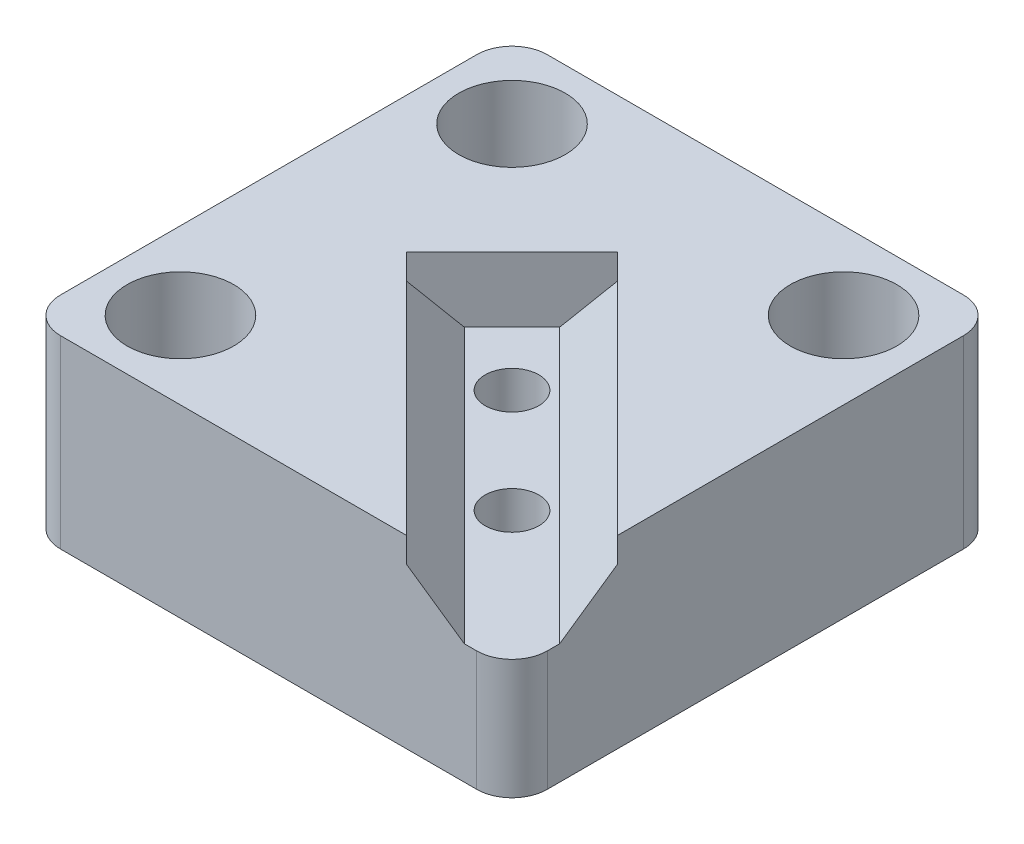
ISO-10303-21;
HEADER;
FILE_DESCRIPTION(('STEP AP214'),'2;1');
FILE_NAME('part.step','',(''),(''),'','','');
FILE_SCHEMA(('AUTOMOTIVE_DESIGN { 1 0 10303 214 1 1 1 1 }'));
ENDSEC;
DATA;
#1=APPLICATION_CONTEXT('core data for automotive mechanical design processes');
#2=APPLICATION_PROTOCOL_DEFINITION('international standard','automotive_design',2000,#1);
#3=PRODUCT_CONTEXT('',#1,'mechanical');
#4=PRODUCT('Part','Part','',(#3));
#5=PRODUCT_RELATED_PRODUCT_CATEGORY('part','',(#4));
#6=PRODUCT_DEFINITION_FORMATION('','',#4);
#7=PRODUCT_DEFINITION_CONTEXT('part definition',#1,'design');
#8=PRODUCT_DEFINITION('design','',#6,#7);
#9=PRODUCT_DEFINITION_SHAPE('','',#8);
#10=(LENGTH_UNIT() NAMED_UNIT(*) SI_UNIT(.MILLI.,.METRE.));
#11=(NAMED_UNIT(*) PLANE_ANGLE_UNIT() SI_UNIT($,.RADIAN.));
#12=(NAMED_UNIT(*) SI_UNIT($,.STERADIAN.) SOLID_ANGLE_UNIT());
#13=UNCERTAINTY_MEASURE_WITH_UNIT(LENGTH_MEASURE(1.E-05),#10,'distance_accuracy_value','');
#14=(GEOMETRIC_REPRESENTATION_CONTEXT(3) GLOBAL_UNCERTAINTY_ASSIGNED_CONTEXT((#13)) GLOBAL_UNIT_ASSIGNED_CONTEXT((#10,
#11,#12)) REPRESENTATION_CONTEXT('',''));
#15=CARTESIAN_POINT('',(0.,0.,0.));
#16=DIRECTION('',(0.,0.,1.));
#17=DIRECTION('',(1.,0.,0.));
#18=AXIS2_PLACEMENT_3D('',#15,#16,#17);
#19=CARTESIAN_POINT('',(28.8663335067468,12.954,23.7116664932532));
#20=DIRECTION('',(0.,-1.,0.));
#21=DIRECTION('',(0.,0.,-1.));
#22=AXIS2_PLACEMENT_3D('',#19,#20,#21);
#23=PLANE('',#22);
#24=CARTESIAN_POINT('',(0.,12.954,0.));
#25=DIRECTION('',(0.,-1.,0.));
#26=DIRECTION('',(0.,0.,-1.));
#27=AXIS2_PLACEMENT_3D('',#24,#25,#26);
#28=CIRCLE('',#27,2.8956);
#29=CARTESIAN_POINT('',(0.,12.954,-2.8956));
#30=VERTEX_POINT('',#29);
#31=EDGE_CURVE('E159',#30,#30,#28,.T.);
#32=ORIENTED_EDGE('',*,*,#31,.T.);
#33=EDGE_LOOP('',(#32));
#34=FACE_BOUND('',#33,.T.);
#35=DIRECTION('',(-1.,0.,0.));
#36=VECTOR('',#35,1.);
#37=CARTESIAN_POINT('',(26.289,12.954,26.289));
#38=LINE('',#37,#36);
#39=CARTESIAN_POINT('',(22.479,12.954,26.289));
#40=VERTEX_POINT('',#39);
#41=CARTESIAN_POINT('',(21.1343329865063,12.954,26.289));
#42=VERTEX_POINT('',#41);
#43=EDGE_CURVE('E179',#40,#42,#38,.T.);
#44=ORIENTED_EDGE('',*,*,#43,.F.);
#45=CARTESIAN_POINT('',(22.479,12.954,22.479));
#46=DIRECTION('',(0.,-1.,0.));
#47=DIRECTION('',(0.,0.,-1.));
#48=AXIS2_PLACEMENT_3D('',#45,#46,#47);
#49=CIRCLE('',#48,3.81);
#50=CARTESIAN_POINT('',(26.289,12.954,22.479));
#51=VERTEX_POINT('',#50);
#52=EDGE_CURVE('E11',#40,#51,#49,.F.);
#53=ORIENTED_EDGE('',*,*,#52,.T.);
#54=DIRECTION('',(0.,0.,1.));
#55=VECTOR('',#54,1.);
#56=CARTESIAN_POINT('',(26.289,12.954,26.289));
#57=LINE('',#56,#55);
#58=CARTESIAN_POINT('',(26.289,12.954,21.1343329865063));
#59=VERTEX_POINT('',#58);
#60=EDGE_CURVE('E244',#59,#51,#57,.T.);
#61=ORIENTED_EDGE('',*,*,#60,.F.);
#62=DIRECTION('',(-0.707106781186547,0.,-0.707106781186547));
#63=VECTOR('',#62,1.);
#64=CARTESIAN_POINT('',(28.8663335067468,12.954,23.7116664932532));
#65=LINE('',#64,#63);
#66=CARTESIAN_POINT('',(-3.3226947647956,12.954,-8.47736177828927));
#67=VERTEX_POINT('',#66);
#68=EDGE_CURVE('E141',#59,#67,#65,.T.);
#69=ORIENTED_EDGE('',*,*,#68,.T.);
#70=DIRECTION('',(-0.707106781186547,0.,0.707106781186548));
#71=VECTOR('',#70,1.);
#72=CARTESIAN_POINT('',(-3.3226947647956,12.954,-8.47736177828927));
#73=LINE('',#72,#71);
#74=CARTESIAN_POINT('',(-8.4773617782893,12.954,-3.32269476479557));
#75=VERTEX_POINT('',#74);
#76=EDGE_CURVE('E151',#67,#75,#73,.T.);
#77=ORIENTED_EDGE('',*,*,#76,.T.);
#78=DIRECTION('',(-0.707106781186547,0.,-0.707106781186547));
#79=VECTOR('',#78,1.);
#80=CARTESIAN_POINT('',(23.7116664932531,12.954,28.8663335067469));
#81=LINE('',#80,#79);
#82=EDGE_CURVE('E172',#42,#75,#81,.T.);
#83=ORIENTED_EDGE('',*,*,#82,.F.);
#84=EDGE_LOOP('',(#44,#53,#61,#69,#77,#83));
#85=FACE_BOUND('',#84,.T.);
#86=CARTESIAN_POINT('',(11.24204,12.954,11.24204));
#87=DIRECTION('',(0.,-1.,0.));
#88=DIRECTION('',(0.,0.,-1.));
#89=AXIS2_PLACEMENT_3D('',#86,#87,#88);
#90=CIRCLE('',#89,2.8956);
#91=CARTESIAN_POINT('',(11.24204,12.954,8.34644));
#92=VERTEX_POINT('',#91);
#93=EDGE_CURVE('E628',#92,#92,#90,.T.);
#94=ORIENTED_EDGE('',*,*,#93,.T.);
#95=EDGE_LOOP('',(#94));
#96=FACE_BOUND('',#95,.T.);
#97=ADVANCED_FACE('F31',(#34,#85,#96),#23,.F.);
#98=CARTESIAN_POINT('',(-26.289,0.,-26.289));
#99=DIRECTION('',(0.,1.,0.));
#100=DIRECTION('',(0.,0.,1.));
#101=AXIS2_PLACEMENT_3D('',#98,#99,#100);
#102=PLANE('',#101);
#103=CARTESIAN_POINT('',(11.24204,0.,11.24204));
#104=DIRECTION('',(0.,-1.,0.));
#105=DIRECTION('',(0.,0.,-1.));
#106=AXIS2_PLACEMENT_3D('',#103,#104,#105);
#107=CIRCLE('',#106,5.9055);
#108=CARTESIAN_POINT('',(11.24204,0.,5.33654));
#109=VERTEX_POINT('',#108);
#110=EDGE_CURVE('E613',#109,#109,#107,.T.);
#111=ORIENTED_EDGE('',*,*,#110,.F.);
#112=EDGE_LOOP('',(#111));
#113=FACE_BOUND('',#112,.T.);
#114=CARTESIAN_POINT('',(0.,0.,0.));
#115=DIRECTION('',(0.,-1.,0.));
#116=DIRECTION('',(0.,0.,-1.));
#117=AXIS2_PLACEMENT_3D('',#114,#115,#116);
#118=CIRCLE('',#117,5.9055);
#119=CARTESIAN_POINT('',(0.,0.,-5.9055));
#120=VERTEX_POINT('',#119);
#121=EDGE_CURVE('E615',#120,#120,#118,.T.);
#122=ORIENTED_EDGE('',*,*,#121,.F.);
#123=EDGE_LOOP('',(#122));
#124=FACE_BOUND('',#123,.T.);
#125=CARTESIAN_POINT('',(-17.907,0.,17.907));
#126=DIRECTION('',(0.,1.,0.));
#127=DIRECTION('',(0.,0.,1.));
#128=AXIS2_PLACEMENT_3D('',#125,#126,#127);
#129=CIRCLE('',#128,2.667);
#130=CARTESIAN_POINT('',(-17.907,0.,20.574));
#131=VERTEX_POINT('',#130);
#132=EDGE_CURVE('E211',#131,#131,#129,.T.);
#133=ORIENTED_EDGE('',*,*,#132,.T.);
#134=EDGE_LOOP('',(#133));
#135=FACE_BOUND('',#134,.T.);
#136=DIRECTION('',(0.,0.,1.));
#137=VECTOR('',#136,1.);
#138=CARTESIAN_POINT('',(-26.289,0.,26.289));
#139=LINE('',#138,#137);
#140=CARTESIAN_POINT('',(-26.289,0.,-22.479));
#141=VERTEX_POINT('',#140);
#142=CARTESIAN_POINT('',(-26.289,0.,22.479));
#143=VERTEX_POINT('',#142);
#144=EDGE_CURVE('E217',#141,#143,#139,.T.);
#145=ORIENTED_EDGE('',*,*,#144,.F.);
#146=CARTESIAN_POINT('',(-22.479,0.,-22.479));
#147=DIRECTION('',(0.,1.,0.));
#148=DIRECTION('',(0.,0.,1.));
#149=AXIS2_PLACEMENT_3D('',#146,#147,#148);
#150=CIRCLE('',#149,3.81);
#151=CARTESIAN_POINT('',(-22.479,0.,-26.289));
#152=VERTEX_POINT('',#151);
#153=EDGE_CURVE('E260',#141,#152,#150,.F.);
#154=ORIENTED_EDGE('',*,*,#153,.T.);
#155=DIRECTION('',(-1.,0.,0.));
#156=VECTOR('',#155,1.);
#157=CARTESIAN_POINT('',(26.289,0.,-26.289));
#158=LINE('',#157,#156);
#159=CARTESIAN_POINT('',(22.479,0.,-26.289));
#160=VERTEX_POINT('',#159);
#161=EDGE_CURVE('E222',#160,#152,#158,.T.);
#162=ORIENTED_EDGE('',*,*,#161,.F.);
#163=CARTESIAN_POINT('',(22.479,0.,-22.479));
#164=DIRECTION('',(0.,1.,0.));
#165=DIRECTION('',(0.,0.,1.));
#166=AXIS2_PLACEMENT_3D('',#163,#164,#165);
#167=CIRCLE('',#166,3.81);
#168=CARTESIAN_POINT('',(26.289,0.,-22.479));
#169=VERTEX_POINT('',#168);
#170=EDGE_CURVE('E258',#160,#169,#167,.F.);
#171=ORIENTED_EDGE('',*,*,#170,.T.);
#172=DIRECTION('',(0.,0.,-1.));
#173=VECTOR('',#172,1.);
#174=CARTESIAN_POINT('',(26.289,0.,26.289));
#175=LINE('',#174,#173);
#176=CARTESIAN_POINT('',(26.289,0.,22.479));
#177=VERTEX_POINT('',#176);
#178=EDGE_CURVE('E234',#177,#169,#175,.T.);
#179=ORIENTED_EDGE('',*,*,#178,.F.);
#180=CARTESIAN_POINT('',(22.479,0.,22.479));
#181=DIRECTION('',(0.,1.,0.));
#182=DIRECTION('',(0.,0.,1.));
#183=AXIS2_PLACEMENT_3D('',#180,#181,#182);
#184=CIRCLE('',#183,3.81);
#185=CARTESIAN_POINT('',(22.479,0.,26.289));
#186=VERTEX_POINT('',#185);
#187=EDGE_CURVE('E254',#177,#186,#184,.F.);
#188=ORIENTED_EDGE('',*,*,#187,.T.);
#189=DIRECTION('',(1.,0.,0.));
#190=VECTOR('',#189,1.);
#191=CARTESIAN_POINT('',(26.289,0.,26.289));
#192=LINE('',#191,#190);
#193=CARTESIAN_POINT('',(-22.479,0.,26.289));
#194=VERTEX_POINT('',#193);
#195=EDGE_CURVE('E232',#194,#186,#192,.T.);
#196=ORIENTED_EDGE('',*,*,#195,.F.);
#197=CARTESIAN_POINT('',(-22.479,0.,22.479));
#198=DIRECTION('',(0.,1.,0.));
#199=DIRECTION('',(0.,0.,1.));
#200=AXIS2_PLACEMENT_3D('',#197,#198,#199);
#201=CIRCLE('',#200,3.81);
#202=EDGE_CURVE('E256',#194,#143,#201,.F.);
#203=ORIENTED_EDGE('',*,*,#202,.T.);
#204=EDGE_LOOP('',(#145,#154,#162,#171,#179,#188,#196,#203));
#205=FACE_BOUND('',#204,.T.);
#206=CARTESIAN_POINT('',(-17.907,0.,-17.907));
#207=DIRECTION('',(0.,1.,0.));
#208=DIRECTION('',(0.,0.,1.));
#209=AXIS2_PLACEMENT_3D('',#206,#207,#208);
#210=CIRCLE('',#209,2.667);
#211=CARTESIAN_POINT('',(-17.907,0.,-15.24));
#212=VERTEX_POINT('',#211);
#213=EDGE_CURVE('E214',#212,#212,#210,.T.);
#214=ORIENTED_EDGE('',*,*,#213,.T.);
#215=EDGE_LOOP('',(#214));
#216=FACE_BOUND('',#215,.T.);
#217=CARTESIAN_POINT('',(17.907,0.,-17.907));
#218=DIRECTION('',(0.,1.,0.));
#219=DIRECTION('',(0.,0.,1.));
#220=AXIS2_PLACEMENT_3D('',#217,#218,#219);
#221=CIRCLE('',#220,2.667);
#222=CARTESIAN_POINT('',(17.907,0.,-15.24));
#223=VERTEX_POINT('',#222);
#224=EDGE_CURVE('E208',#223,#223,#221,.T.);
#225=ORIENTED_EDGE('',*,*,#224,.T.);
#226=EDGE_LOOP('',(#225));
#227=FACE_BOUND('',#226,.T.);
#228=ADVANCED_FACE('F287',(#113,#124,#135,#205,#216,#227),#102,.F.);
#229=CARTESIAN_POINT('',(-26.289,19.9644,26.289));
#230=DIRECTION('',(1.,0.,0.));
#231=DIRECTION('',(0.,0.,-1.));
#232=AXIS2_PLACEMENT_3D('',#229,#230,#231);
#233=PLANE('',#232);
#234=DIRECTION('',(0.,0.,1.));
#235=VECTOR('',#234,1.);
#236=CARTESIAN_POINT('',(-26.289,19.9644,26.289));
#237=LINE('',#236,#235);
#238=CARTESIAN_POINT('',(-26.289,19.9644,-22.479));
#239=VERTEX_POINT('',#238);
#240=CARTESIAN_POINT('',(-26.289,19.9644,22.479));
#241=VERTEX_POINT('',#240);
#242=EDGE_CURVE('E218',#239,#241,#237,.T.);
#243=ORIENTED_EDGE('',*,*,#242,.F.);
#244=DIRECTION('',(0.,-1.,0.));
#245=VECTOR('',#244,1.);
#246=CARTESIAN_POINT('',(-26.289,19.9644,-22.479));
#247=LINE('',#246,#245);
#248=EDGE_CURVE('E251',#239,#141,#247,.T.);
#249=ORIENTED_EDGE('',*,*,#248,.T.);
#250=ORIENTED_EDGE('',*,*,#144,.T.);
#251=DIRECTION('',(0.,-1.,0.));
#252=VECTOR('',#251,1.);
#253=CARTESIAN_POINT('',(-26.289,19.9644,22.479));
#254=LINE('',#253,#252);
#255=EDGE_CURVE('E249',#143,#241,#254,.F.);
#256=ORIENTED_EDGE('',*,*,#255,.T.);
#257=EDGE_LOOP('',(#243,#249,#250,#256));
#258=FACE_BOUND('',#257,.T.);
#259=ADVANCED_FACE('F312',(#258),#233,.F.);
#260=CARTESIAN_POINT('',(26.289,19.9644,26.289));
#261=DIRECTION('',(0.,0.,-1.));
#262=DIRECTION('',(-1.,0.,0.));
#263=AXIS2_PLACEMENT_3D('',#260,#261,#262);
#264=PLANE('',#263);
#265=DIRECTION('',(1.,0.,0.));
#266=VECTOR('',#265,1.);
#267=CARTESIAN_POINT('',(26.289,19.9644,26.289));
#268=LINE('',#267,#266);
#269=CARTESIAN_POINT('',(-22.479,19.9644,26.289));
#270=VERTEX_POINT('',#269);
#271=CARTESIAN_POINT('',(14.8840747262422,19.9644,26.289));
#272=VERTEX_POINT('',#271);
#273=EDGE_CURVE('E221',#270,#272,#268,.T.);
#274=ORIENTED_EDGE('',*,*,#273,.F.);
#275=DIRECTION('',(0.,-1.,0.));
#276=VECTOR('',#275,1.);
#277=CARTESIAN_POINT('',(-22.479,19.9644,26.289));
#278=LINE('',#277,#276);
#279=EDGE_CURVE('E39',#270,#194,#278,.T.);
#280=ORIENTED_EDGE('',*,*,#279,.T.);
#281=ORIENTED_EDGE('',*,*,#195,.T.);
#282=DIRECTION('',(0.,-1.,0.));
#283=VECTOR('',#282,1.);
#284=CARTESIAN_POINT('',(22.479,19.9644,26.289));
#285=LINE('',#284,#283);
#286=EDGE_CURVE('E46',#186,#40,#285,.F.);
#287=ORIENTED_EDGE('',*,*,#286,.T.);
#288=ORIENTED_EDGE('',*,*,#43,.T.);
#289=DIRECTION('',(-0.822752515051769,0.568399770386995,0.));
#290=VECTOR('',#289,1.);
#291=CARTESIAN_POINT('',(21.3452089806649,12.8083160130573,26.289));
#292=LINE('',#291,#290);
#293=CARTESIAN_POINT('',(14.8840747262422,17.272,26.289));
#294=VERTEX_POINT('',#293);
#295=EDGE_CURVE('E246',#42,#294,#292,.T.);
#296=ORIENTED_EDGE('',*,*,#295,.T.);
#297=DIRECTION('',(0.,1.,0.));
#298=VECTOR('',#297,1.);
#299=CARTESIAN_POINT('',(14.8840747262422,19.9644,26.289));
#300=LINE('',#299,#298);
#301=EDGE_CURVE('E176',#294,#272,#300,.T.);
#302=ORIENTED_EDGE('',*,*,#301,.T.);
#303=EDGE_LOOP('',(#274,#280,#281,#287,#288,#296,#302));
#304=FACE_BOUND('',#303,.T.);
#305=ADVANCED_FACE('F282',(#304),#264,.F.);
#306=CARTESIAN_POINT('',(26.289,19.9644,26.289));
#307=DIRECTION('',(-1.,0.,0.));
#308=DIRECTION('',(0.,0.,1.));
#309=AXIS2_PLACEMENT_3D('',#306,#307,#308);
#310=PLANE('',#309);
#311=ORIENTED_EDGE('',*,*,#178,.T.);
#312=DIRECTION('',(0.,-1.,0.));
#313=VECTOR('',#312,1.);
#314=CARTESIAN_POINT('',(26.289,19.9644,-22.479));
#315=LINE('',#314,#313);
#316=CARTESIAN_POINT('',(26.289,19.9644,-22.479));
#317=VERTEX_POINT('',#316);
#318=EDGE_CURVE('E276',#169,#317,#315,.F.);
#319=ORIENTED_EDGE('',*,*,#318,.T.);
#320=DIRECTION('',(0.,0.,-1.));
#321=VECTOR('',#320,1.);
#322=CARTESIAN_POINT('',(26.289,19.9644,26.289));
#323=LINE('',#322,#321);
#324=CARTESIAN_POINT('',(26.289,19.9644,14.8840747262422));
#325=VERTEX_POINT('',#324);
#326=EDGE_CURVE('E224',#325,#317,#323,.T.);
#327=ORIENTED_EDGE('',*,*,#326,.F.);
#328=DIRECTION('',(0.,-1.,0.));
#329=VECTOR('',#328,1.);
#330=CARTESIAN_POINT('',(26.289,19.9644,14.8840747262422));
#331=LINE('',#330,#329);
#332=CARTESIAN_POINT('',(26.289,17.272,14.8840747262422));
#333=VERTEX_POINT('',#332);
#334=EDGE_CURVE('E171',#325,#333,#331,.T.);
#335=ORIENTED_EDGE('',*,*,#334,.T.);
#336=DIRECTION('',(0.,-0.568399770386992,0.822752515051771));
#337=VECTOR('',#336,1.);
#338=CARTESIAN_POINT('',(26.289,12.8083160130573,21.3452089806649));
#339=LINE('',#338,#337);
#340=EDGE_CURVE('E137',#333,#59,#339,.T.);
#341=ORIENTED_EDGE('',*,*,#340,.T.);
#342=ORIENTED_EDGE('',*,*,#60,.T.);
#343=DIRECTION('',(0.,-1.,0.));
#344=VECTOR('',#343,1.);
#345=CARTESIAN_POINT('',(26.289,19.9644,22.479));
#346=LINE('',#345,#344);
#347=EDGE_CURVE('E273',#51,#177,#346,.T.);
#348=ORIENTED_EDGE('',*,*,#347,.T.);
#349=EDGE_LOOP('',(#311,#319,#327,#335,#341,#342,#348));
#350=FACE_BOUND('',#349,.T.);
#351=ADVANCED_FACE('F293',(#350),#310,.F.);
#352=CARTESIAN_POINT('',(26.289,19.9644,-26.289));
#353=DIRECTION('',(0.,0.,1.));
#354=DIRECTION('',(1.,0.,0.));
#355=AXIS2_PLACEMENT_3D('',#352,#353,#354);
#356=PLANE('',#355);
#357=ORIENTED_EDGE('',*,*,#161,.T.);
#358=DIRECTION('',(0.,-1.,0.));
#359=VECTOR('',#358,1.);
#360=CARTESIAN_POINT('',(-22.479,19.9644,-26.289));
#361=LINE('',#360,#359);
#362=CARTESIAN_POINT('',(-22.479,19.9644,-26.289));
#363=VERTEX_POINT('',#362);
#364=EDGE_CURVE('E265',#152,#363,#361,.F.);
#365=ORIENTED_EDGE('',*,*,#364,.T.);
#366=DIRECTION('',(-1.,0.,0.));
#367=VECTOR('',#366,1.);
#368=CARTESIAN_POINT('',(26.289,19.9644,-26.289));
#369=LINE('',#368,#367);
#370=CARTESIAN_POINT('',(22.479,19.9644,-26.289));
#371=VERTEX_POINT('',#370);
#372=EDGE_CURVE('E227',#371,#363,#369,.T.);
#373=ORIENTED_EDGE('',*,*,#372,.F.);
#374=DIRECTION('',(0.,-1.,0.));
#375=VECTOR('',#374,1.);
#376=CARTESIAN_POINT('',(22.479,19.9644,-26.289));
#377=LINE('',#376,#375);
#378=EDGE_CURVE('E262',#371,#160,#377,.T.);
#379=ORIENTED_EDGE('',*,*,#378,.T.);
#380=EDGE_LOOP('',(#357,#365,#373,#379));
#381=FACE_BOUND('',#380,.T.);
#382=ADVANCED_FACE('F318',(#381),#356,.F.);
#383=CARTESIAN_POINT('',(-26.289,19.9644,-26.289));
#384=DIRECTION('',(0.,1.,0.));
#385=DIRECTION('',(0.,0.,1.));
#386=AXIS2_PLACEMENT_3D('',#383,#384,#385);
#387=PLANE('',#386);
#388=ORIENTED_EDGE('',*,*,#372,.T.);
#389=CARTESIAN_POINT('',(-22.479,19.9644,-22.479));
#390=DIRECTION('',(0.,1.,0.));
#391=DIRECTION('',(0.,0.,1.));
#392=AXIS2_PLACEMENT_3D('',#389,#390,#391);
#393=CIRCLE('',#392,3.81);
#394=EDGE_CURVE('E271',#363,#239,#393,.T.);
#395=ORIENTED_EDGE('',*,*,#394,.T.);
#396=ORIENTED_EDGE('',*,*,#242,.T.);
#397=CARTESIAN_POINT('',(-22.479,19.9644,22.479));
#398=DIRECTION('',(0.,1.,0.));
#399=DIRECTION('',(0.,0.,1.));
#400=AXIS2_PLACEMENT_3D('',#397,#398,#399);
#401=CIRCLE('',#400,3.81);
#402=EDGE_CURVE('E267',#241,#270,#401,.T.);
#403=ORIENTED_EDGE('',*,*,#402,.T.);
#404=ORIENTED_EDGE('',*,*,#273,.T.);
#405=DIRECTION('',(0.707106781186548,0.,0.707106781186548));
#406=VECTOR('',#405,1.);
#407=CARTESIAN_POINT('',(-31.9914626368789,19.9644,-20.5865373631211));
#408=LINE('',#407,#406);
#409=CARTESIAN_POINT('',(-11.6024909084213,19.9644,-0.197565634663523));
#410=VERTEX_POINT('',#409);
#411=EDGE_CURVE('E240',#410,#272,#408,.T.);
#412=ORIENTED_EDGE('',*,*,#411,.F.);
#413=DIRECTION('',(0.707106781186548,0.,-0.707106781186548));
#414=VECTOR('',#413,1.);
#415=CARTESIAN_POINT('',(-11.6024909084213,19.9644,-0.197565634663523));
#416=LINE('',#415,#414);
#417=CARTESIAN_POINT('',(-0.197565634663529,19.9644,-11.6024909084213));
#418=VERTEX_POINT('',#417);
#419=EDGE_CURVE('E157',#410,#418,#416,.T.);
#420=ORIENTED_EDGE('',*,*,#419,.T.);
#421=DIRECTION('',(-0.707106781186548,0.,-0.707106781186548));
#422=VECTOR('',#421,1.);
#423=CARTESIAN_POINT('',(-20.5865373631211,19.9644,-31.9914626368789));
#424=LINE('',#423,#422);
#425=EDGE_CURVE('E155',#325,#418,#424,.T.);
#426=ORIENTED_EDGE('',*,*,#425,.F.);
#427=ORIENTED_EDGE('',*,*,#326,.T.);
#428=CARTESIAN_POINT('',(22.479,19.9644,-22.479));
#429=DIRECTION('',(0.,1.,0.));
#430=DIRECTION('',(0.,0.,1.));
#431=AXIS2_PLACEMENT_3D('',#428,#429,#430);
#432=CIRCLE('',#431,3.81);
#433=EDGE_CURVE('E269',#317,#371,#432,.T.);
#434=ORIENTED_EDGE('',*,*,#433,.T.);
#435=EDGE_LOOP('',(#388,#395,#396,#403,#404,#412,#420,#426,#427,#434));
#436=FACE_BOUND('',#435,.T.);
#437=CARTESIAN_POINT('',(17.907,19.9644,-17.907));
#438=DIRECTION('',(0.,1.,0.));
#439=DIRECTION('',(0.,0.,1.));
#440=AXIS2_PLACEMENT_3D('',#437,#438,#439);
#441=CIRCLE('',#440,5.75437);
#442=CARTESIAN_POINT('',(17.907,19.9644,-12.15263));
#443=VERTEX_POINT('',#442);
#444=EDGE_CURVE('E181',#443,#443,#441,.T.);
#445=ORIENTED_EDGE('',*,*,#444,.F.);
#446=EDGE_LOOP('',(#445));
#447=FACE_BOUND('',#446,.T.);
#448=CARTESIAN_POINT('',(-17.907,19.9644,17.907));
#449=DIRECTION('',(0.,1.,0.));
#450=DIRECTION('',(0.,0.,1.));
#451=AXIS2_PLACEMENT_3D('',#448,#449,#450);
#452=CIRCLE('',#451,5.75437);
#453=CARTESIAN_POINT('',(-17.907,19.9644,23.66137));
#454=VERTEX_POINT('',#453);
#455=EDGE_CURVE('E190',#454,#454,#452,.T.);
#456=ORIENTED_EDGE('',*,*,#455,.F.);
#457=EDGE_LOOP('',(#456));
#458=FACE_BOUND('',#457,.T.);
#459=CARTESIAN_POINT('',(-17.907,19.9644,-17.907));
#460=DIRECTION('',(0.,1.,0.));
#461=DIRECTION('',(0.,0.,1.));
#462=AXIS2_PLACEMENT_3D('',#459,#460,#461);
#463=CIRCLE('',#462,5.75437);
#464=CARTESIAN_POINT('',(-17.907,19.9644,-12.15263));
#465=VERTEX_POINT('',#464);
#466=EDGE_CURVE('E199',#465,#465,#463,.T.);
#467=ORIENTED_EDGE('',*,*,#466,.F.);
#468=EDGE_LOOP('',(#467));
#469=FACE_BOUND('',#468,.T.);
#470=ADVANCED_FACE('F306',(#436,#447,#458,#469),#387,.T.);
#471=CARTESIAN_POINT('',(-17.907,5.7658,-17.907));
#472=DIRECTION('',(0.,-1.,0.));
#473=DIRECTION('',(0.,0.,-1.));
#474=AXIS2_PLACEMENT_3D('',#471,#472,#473);
#475=CYLINDRICAL_SURFACE('',#474,2.667);
#476=CARTESIAN_POINT('',(-17.907,5.7658,-17.907));
#477=DIRECTION('',(0.,1.,0.));
#478=DIRECTION('',(0.,0.,1.));
#479=AXIS2_PLACEMENT_3D('',#476,#477,#478);
#480=CIRCLE('',#479,2.667);
#481=CARTESIAN_POINT('',(-17.907,5.7658,-15.24));
#482=VERTEX_POINT('',#481);
#483=EDGE_CURVE('E203',#482,#482,#480,.T.);
#484=ORIENTED_EDGE('',*,*,#483,.T.);
#485=EDGE_LOOP('',(#484));
#486=FACE_BOUND('',#485,.T.);
#487=ORIENTED_EDGE('',*,*,#213,.F.);
#488=EDGE_LOOP('',(#487));
#489=FACE_BOUND('',#488,.T.);
#490=ADVANCED_FACE('F382',(#486,#489),#475,.F.);
#491=CARTESIAN_POINT('',(-17.907,5.7658,17.907));
#492=DIRECTION('',(0.,-1.,0.));
#493=DIRECTION('',(0.,0.,-1.));
#494=AXIS2_PLACEMENT_3D('',#491,#492,#493);
#495=CYLINDRICAL_SURFACE('',#494,2.667);
#496=CARTESIAN_POINT('',(-17.907,5.7658,17.907));
#497=DIRECTION('',(0.,1.,0.));
#498=DIRECTION('',(0.,0.,1.));
#499=AXIS2_PLACEMENT_3D('',#496,#497,#498);
#500=CIRCLE('',#499,2.667);
#501=CARTESIAN_POINT('',(-17.907,5.7658,20.574));
#502=VERTEX_POINT('',#501);
#503=EDGE_CURVE('E194',#502,#502,#500,.T.);
#504=ORIENTED_EDGE('',*,*,#503,.T.);
#505=EDGE_LOOP('',(#504));
#506=FACE_BOUND('',#505,.T.);
#507=ORIENTED_EDGE('',*,*,#132,.F.);
#508=EDGE_LOOP('',(#507));
#509=FACE_BOUND('',#508,.T.);
#510=ADVANCED_FACE('F378',(#506,#509),#495,.F.);
#511=CARTESIAN_POINT('',(17.907,5.7658,-17.907));
#512=DIRECTION('',(0.,-1.,0.));
#513=DIRECTION('',(0.,0.,-1.));
#514=AXIS2_PLACEMENT_3D('',#511,#512,#513);
#515=CYLINDRICAL_SURFACE('',#514,2.667);
#516=CARTESIAN_POINT('',(17.907,5.7658,-17.907));
#517=DIRECTION('',(0.,1.,0.));
#518=DIRECTION('',(0.,0.,1.));
#519=AXIS2_PLACEMENT_3D('',#516,#517,#518);
#520=CIRCLE('',#519,2.667);
#521=CARTESIAN_POINT('',(17.907,5.7658,-15.24));
#522=VERTEX_POINT('',#521);
#523=EDGE_CURVE('E185',#522,#522,#520,.T.);
#524=ORIENTED_EDGE('',*,*,#523,.T.);
#525=EDGE_LOOP('',(#524));
#526=FACE_BOUND('',#525,.T.);
#527=ORIENTED_EDGE('',*,*,#224,.F.);
#528=EDGE_LOOP('',(#527));
#529=FACE_BOUND('',#528,.T.);
#530=ADVANCED_FACE('F374',(#526,#529),#515,.F.);
#531=CARTESIAN_POINT('',(-17.907,5.7658,-17.907));
#532=DIRECTION('',(0.,1.,0.));
#533=DIRECTION('',(0.,0.,1.));
#534=AXIS2_PLACEMENT_3D('',#531,#532,#533);
#535=CYLINDRICAL_SURFACE('',#534,5.75437);
#536=CARTESIAN_POINT('',(-17.907,5.7658,-17.907));
#537=DIRECTION('',(0.,1.,0.));
#538=DIRECTION('',(0.,0.,1.));
#539=AXIS2_PLACEMENT_3D('',#536,#537,#538);
#540=CIRCLE('',#539,5.75437);
#541=CARTESIAN_POINT('',(-17.907,5.7658,-12.15263));
#542=VERTEX_POINT('',#541);
#543=EDGE_CURVE('E200',#542,#542,#540,.T.);
#544=ORIENTED_EDGE('',*,*,#543,.F.);
#545=EDGE_LOOP('',(#544));
#546=FACE_BOUND('',#545,.T.);
#547=ORIENTED_EDGE('',*,*,#466,.T.);
#548=EDGE_LOOP('',(#547));
#549=FACE_BOUND('',#548,.T.);
#550=ADVANCED_FACE('F370',(#546,#549),#535,.F.);
#551=CARTESIAN_POINT('',(-17.907,5.7658,-17.907));
#552=DIRECTION('',(0.,1.,0.));
#553=DIRECTION('',(0.,0.,1.));
#554=AXIS2_PLACEMENT_3D('',#551,#552,#553);
#555=PLANE('',#554);
#556=ORIENTED_EDGE('',*,*,#483,.F.);
#557=EDGE_LOOP('',(#556));
#558=FACE_BOUND('',#557,.T.);
#559=ORIENTED_EDGE('',*,*,#543,.T.);
#560=EDGE_LOOP('',(#559));
#561=FACE_BOUND('',#560,.T.);
#562=ADVANCED_FACE('F366',(#558,#561),#555,.T.);
#563=CARTESIAN_POINT('',(-17.907,5.7658,17.907));
#564=DIRECTION('',(0.,1.,0.));
#565=DIRECTION('',(0.,0.,1.));
#566=AXIS2_PLACEMENT_3D('',#563,#564,#565);
#567=CYLINDRICAL_SURFACE('',#566,5.75437);
#568=CARTESIAN_POINT('',(-17.907,5.7658,17.907));
#569=DIRECTION('',(0.,1.,0.));
#570=DIRECTION('',(0.,0.,1.));
#571=AXIS2_PLACEMENT_3D('',#568,#569,#570);
#572=CIRCLE('',#571,5.75437);
#573=CARTESIAN_POINT('',(-17.907,5.7658,23.66137));
#574=VERTEX_POINT('',#573);
#575=EDGE_CURVE('E191',#574,#574,#572,.T.);
#576=ORIENTED_EDGE('',*,*,#575,.F.);
#577=EDGE_LOOP('',(#576));
#578=FACE_BOUND('',#577,.T.);
#579=ORIENTED_EDGE('',*,*,#455,.T.);
#580=EDGE_LOOP('',(#579));
#581=FACE_BOUND('',#580,.T.);
#582=ADVANCED_FACE('F362',(#578,#581),#567,.F.);
#583=CARTESIAN_POINT('',(-17.907,5.7658,17.907));
#584=DIRECTION('',(0.,1.,0.));
#585=DIRECTION('',(0.,0.,1.));
#586=AXIS2_PLACEMENT_3D('',#583,#584,#585);
#587=PLANE('',#586);
#588=ORIENTED_EDGE('',*,*,#503,.F.);
#589=EDGE_LOOP('',(#588));
#590=FACE_BOUND('',#589,.T.);
#591=ORIENTED_EDGE('',*,*,#575,.T.);
#592=EDGE_LOOP('',(#591));
#593=FACE_BOUND('',#592,.T.);
#594=ADVANCED_FACE('F358',(#590,#593),#587,.T.);
#595=CARTESIAN_POINT('',(17.907,5.7658,-17.907));
#596=DIRECTION('',(0.,1.,0.));
#597=DIRECTION('',(0.,0.,1.));
#598=AXIS2_PLACEMENT_3D('',#595,#596,#597);
#599=CYLINDRICAL_SURFACE('',#598,5.75437);
#600=CARTESIAN_POINT('',(17.907,5.7658,-17.907));
#601=DIRECTION('',(0.,1.,0.));
#602=DIRECTION('',(0.,0.,1.));
#603=AXIS2_PLACEMENT_3D('',#600,#601,#602);
#604=CIRCLE('',#603,5.75437);
#605=CARTESIAN_POINT('',(17.907,5.7658,-12.15263));
#606=VERTEX_POINT('',#605);
#607=EDGE_CURVE('E182',#606,#606,#604,.T.);
#608=ORIENTED_EDGE('',*,*,#607,.F.);
#609=EDGE_LOOP('',(#608));
#610=FACE_BOUND('',#609,.T.);
#611=ORIENTED_EDGE('',*,*,#444,.T.);
#612=EDGE_LOOP('',(#611));
#613=FACE_BOUND('',#612,.T.);
#614=ADVANCED_FACE('F354',(#610,#613),#599,.F.);
#615=CARTESIAN_POINT('',(17.907,5.7658,-17.907));
#616=DIRECTION('',(0.,1.,0.));
#617=DIRECTION('',(0.,0.,1.));
#618=AXIS2_PLACEMENT_3D('',#615,#616,#617);
#619=PLANE('',#618);
#620=ORIENTED_EDGE('',*,*,#523,.F.);
#621=EDGE_LOOP('',(#620));
#622=FACE_BOUND('',#621,.T.);
#623=ORIENTED_EDGE('',*,*,#607,.T.);
#624=EDGE_LOOP('',(#623));
#625=FACE_BOUND('',#624,.T.);
#626=ADVANCED_FACE('F351',(#622,#625),#619,.T.);
#627=CARTESIAN_POINT('',(23.7116664932531,12.954,28.8663335067469));
#628=DIRECTION('',(-0.494152640891114,-0.71528059878671,0.494152640891114));
#629=DIRECTION('',(0.,-0.568399770386995,-0.822752515051769));
#630=AXIS2_PLACEMENT_3D('',#627,#628,#629);
#631=PLANE('',#630);
#632=ORIENTED_EDGE('',*,*,#82,.T.);
#633=DIRECTION('',(-0.505779761853257,0.698837366630696,0.505779761853257));
#634=VECTOR('',#633,1.);
#635=CARTESIAN_POINT('',(-8.4773617782893,12.954,-3.32269476479557));
#636=LINE('',#635,#634);
#637=CARTESIAN_POINT('',(-11.6024909084214,17.272,-0.197565634663516));
#638=VERTEX_POINT('',#637);
#639=EDGE_CURVE('E164',#75,#638,#636,.T.);
#640=ORIENTED_EDGE('',*,*,#639,.T.);
#641=DIRECTION('',(-0.707106781186547,0.,-0.707106781186547));
#642=VECTOR('',#641,1.);
#643=CARTESIAN_POINT('',(20.5865373631211,17.272,31.9914626368789));
#644=LINE('',#643,#642);
#645=EDGE_CURVE('E169',#294,#638,#644,.T.);
#646=ORIENTED_EDGE('',*,*,#645,.F.);
#647=ORIENTED_EDGE('',*,*,#295,.F.);
#648=EDGE_LOOP('',(#632,#640,#646,#647));
#649=FACE_BOUND('',#648,.T.);
#650=ADVANCED_FACE('F299',(#649),#631,.F.);
#651=CARTESIAN_POINT('',(31.9914626368789,17.272,20.5865373631211));
#652=DIRECTION('',(0.494152640891113,-0.715280598786712,-0.494152640891113));
#653=DIRECTION('',(0.,0.568399770386992,-0.822752515051771));
#654=AXIS2_PLACEMENT_3D('',#651,#652,#653);
#655=PLANE('',#654);
#656=DIRECTION('',(-0.707106781186547,0.,-0.707106781186547));
#657=VECTOR('',#656,1.);
#658=CARTESIAN_POINT('',(31.9914626368789,17.272,20.5865373631211));
#659=LINE('',#658,#657);
#660=CARTESIAN_POINT('',(-0.197565634663529,17.272,-11.6024909084213));
#661=VERTEX_POINT('',#660);
#662=EDGE_CURVE('E131',#333,#661,#659,.T.);
#663=ORIENTED_EDGE('',*,*,#662,.T.);
#664=DIRECTION('',(-0.505779761853258,-0.698837366630694,0.505779761853259));
#665=VECTOR('',#664,1.);
#666=CARTESIAN_POINT('',(-0.197565634663529,17.272,-11.6024909084213));
#667=LINE('',#666,#665);
#668=EDGE_CURVE('E135',#661,#67,#667,.T.);
#669=ORIENTED_EDGE('',*,*,#668,.T.);
#670=ORIENTED_EDGE('',*,*,#68,.F.);
#671=ORIENTED_EDGE('',*,*,#340,.F.);
#672=EDGE_LOOP('',(#663,#669,#670,#671));
#673=FACE_BOUND('',#672,.T.);
#674=ADVANCED_FACE('F133',(#673),#655,.F.);
#675=CARTESIAN_POINT('',(20.5865373631211,17.272,31.9914626368789));
#676=DIRECTION('',(-0.707106781186547,0.,0.707106781186547));
#677=DIRECTION('',(0.707106781186548,0.,0.707106781186548));
#678=AXIS2_PLACEMENT_3D('',#675,#676,#677);
#679=PLANE('',#678);
#680=ORIENTED_EDGE('',*,*,#645,.T.);
#681=DIRECTION('',(0.,1.,0.));
#682=VECTOR('',#681,1.);
#683=CARTESIAN_POINT('',(-11.6024909084214,17.272,-0.197565634663516));
#684=LINE('',#683,#682);
#685=EDGE_CURVE('E142',#638,#410,#684,.T.);
#686=ORIENTED_EDGE('',*,*,#685,.T.);
#687=ORIENTED_EDGE('',*,*,#411,.T.);
#688=ORIENTED_EDGE('',*,*,#301,.F.);
#689=EDGE_LOOP('',(#680,#686,#687,#688));
#690=FACE_BOUND('',#689,.T.);
#691=ADVANCED_FACE('F304',(#690),#679,.F.);
#692=CARTESIAN_POINT('',(31.9914626368789,19.9644,20.5865373631211));
#693=DIRECTION('',(0.707106781186547,0.,-0.707106781186547));
#694=DIRECTION('',(-0.707106781186548,0.,-0.707106781186548));
#695=AXIS2_PLACEMENT_3D('',#692,#693,#694);
#696=PLANE('',#695);
#697=ORIENTED_EDGE('',*,*,#425,.T.);
#698=DIRECTION('',(0.,-1.,0.));
#699=VECTOR('',#698,1.);
#700=CARTESIAN_POINT('',(-0.197565634663523,19.9644,-11.6024909084213));
#701=LINE('',#700,#699);
#702=EDGE_CURVE('E147',#418,#661,#701,.T.);
#703=ORIENTED_EDGE('',*,*,#702,.T.);
#704=ORIENTED_EDGE('',*,*,#662,.F.);
#705=ORIENTED_EDGE('',*,*,#334,.F.);
#706=EDGE_LOOP('',(#697,#703,#704,#705));
#707=FACE_BOUND('',#706,.T.);
#708=ADVANCED_FACE('F153',(#707),#696,.F.);
#709=CARTESIAN_POINT('',(-0.197565634663523,19.9644,-11.6024909084213));
#710=DIRECTION('',(-0.707106781186548,0.,-0.707106781186548));
#711=DIRECTION('',(-0.707106781186548,0.,0.707106781186548));
#712=AXIS2_PLACEMENT_3D('',#709,#710,#711);
#713=PLANE('',#712);
#714=ORIENTED_EDGE('',*,*,#419,.F.);
#715=ORIENTED_EDGE('',*,*,#685,.F.);
#716=ORIENTED_EDGE('',*,*,#639,.F.);
#717=ORIENTED_EDGE('',*,*,#76,.F.);
#718=ORIENTED_EDGE('',*,*,#668,.F.);
#719=ORIENTED_EDGE('',*,*,#702,.F.);
#720=EDGE_LOOP('',(#714,#715,#716,#717,#718,#719));
#721=FACE_BOUND('',#720,.T.);
#722=ADVANCED_FACE('F146',(#721),#713,.F.);
#723=CARTESIAN_POINT('',(0.,5.08,0.));
#724=DIRECTION('',(0.,1.,0.));
#725=DIRECTION('',(0.,0.,1.));
#726=AXIS2_PLACEMENT_3D('',#723,#724,#725);
#727=CYLINDRICAL_SURFACE('',#726,2.8956);
#728=CARTESIAN_POINT('',(0.,5.08,0.));
#729=DIRECTION('',(0.,-1.,0.));
#730=DIRECTION('',(0.,0.,-1.));
#731=AXIS2_PLACEMENT_3D('',#728,#729,#730);
#732=CIRCLE('',#731,2.8956);
#733=CARTESIAN_POINT('',(0.,5.08,-2.8956));
#734=VERTEX_POINT('',#733);
#735=EDGE_CURVE('E623',#734,#734,#732,.T.);
#736=ORIENTED_EDGE('',*,*,#735,.T.);
#737=EDGE_LOOP('',(#736));
#738=FACE_BOUND('',#737,.T.);
#739=ORIENTED_EDGE('',*,*,#31,.F.);
#740=EDGE_LOOP('',(#739));
#741=FACE_BOUND('',#740,.T.);
#742=ADVANCED_FACE('F477',(#738,#741),#727,.F.);
#743=CARTESIAN_POINT('',(11.24204,5.08,11.24204));
#744=DIRECTION('',(0.,1.,0.));
#745=DIRECTION('',(0.,0.,1.));
#746=AXIS2_PLACEMENT_3D('',#743,#744,#745);
#747=CYLINDRICAL_SURFACE('',#746,2.8956);
#748=CARTESIAN_POINT('',(11.24204,5.08,11.24204));
#749=DIRECTION('',(0.,-1.,0.));
#750=DIRECTION('',(0.,0.,-1.));
#751=AXIS2_PLACEMENT_3D('',#748,#749,#750);
#752=CIRCLE('',#751,2.8956);
#753=CARTESIAN_POINT('',(11.24204,5.08,8.34644));
#754=VERTEX_POINT('',#753);
#755=EDGE_CURVE('E609',#754,#754,#752,.T.);
#756=ORIENTED_EDGE('',*,*,#755,.T.);
#757=EDGE_LOOP('',(#756));
#758=FACE_BOUND('',#757,.T.);
#759=ORIENTED_EDGE('',*,*,#93,.F.);
#760=EDGE_LOOP('',(#759));
#761=FACE_BOUND('',#760,.T.);
#762=ADVANCED_FACE('F484',(#758,#761),#747,.F.);
#763=CARTESIAN_POINT('',(0.,5.08,0.));
#764=DIRECTION('',(0.,-1.,0.));
#765=DIRECTION('',(0.,0.,-1.));
#766=AXIS2_PLACEMENT_3D('',#763,#764,#765);
#767=CYLINDRICAL_SURFACE('',#766,5.9055);
#768=CARTESIAN_POINT('',(0.,5.08,0.));
#769=DIRECTION('',(0.,-1.,0.));
#770=DIRECTION('',(0.,0.,-1.));
#771=AXIS2_PLACEMENT_3D('',#768,#769,#770);
#772=CIRCLE('',#771,5.9055);
#773=CARTESIAN_POINT('',(0.,5.08,-5.9055));
#774=VERTEX_POINT('',#773);
#775=EDGE_CURVE('E620',#774,#774,#772,.T.);
#776=ORIENTED_EDGE('',*,*,#775,.F.);
#777=EDGE_LOOP('',(#776));
#778=FACE_BOUND('',#777,.T.);
#779=ORIENTED_EDGE('',*,*,#121,.T.);
#780=EDGE_LOOP('',(#779));
#781=FACE_BOUND('',#780,.T.);
#782=ADVANCED_FACE('F492',(#778,#781),#767,.F.);
#783=CARTESIAN_POINT('',(0.,5.08,0.));
#784=DIRECTION('',(0.,-1.,0.));
#785=DIRECTION('',(0.,0.,-1.));
#786=AXIS2_PLACEMENT_3D('',#783,#784,#785);
#787=PLANE('',#786);
#788=ORIENTED_EDGE('',*,*,#735,.F.);
#789=EDGE_LOOP('',(#788));
#790=FACE_BOUND('',#789,.T.);
#791=ORIENTED_EDGE('',*,*,#775,.T.);
#792=EDGE_LOOP('',(#791));
#793=FACE_BOUND('',#792,.T.);
#794=ADVANCED_FACE('F500',(#790,#793),#787,.T.);
#795=CARTESIAN_POINT('',(11.24204,5.08,11.24204));
#796=DIRECTION('',(0.,-1.,0.));
#797=DIRECTION('',(0.,0.,-1.));
#798=AXIS2_PLACEMENT_3D('',#795,#796,#797);
#799=CYLINDRICAL_SURFACE('',#798,5.9055);
#800=CARTESIAN_POINT('',(11.24204,5.08,11.24204));
#801=DIRECTION('',(0.,-1.,0.));
#802=DIRECTION('',(0.,0.,-1.));
#803=AXIS2_PLACEMENT_3D('',#800,#801,#802);
#804=CIRCLE('',#803,5.9055);
#805=CARTESIAN_POINT('',(11.24204,5.08,5.33654));
#806=VERTEX_POINT('',#805);
#807=EDGE_CURVE('E612',#806,#806,#804,.T.);
#808=ORIENTED_EDGE('',*,*,#807,.F.);
#809=EDGE_LOOP('',(#808));
#810=FACE_BOUND('',#809,.T.);
#811=ORIENTED_EDGE('',*,*,#110,.T.);
#812=EDGE_LOOP('',(#811));
#813=FACE_BOUND('',#812,.T.);
#814=ADVANCED_FACE('F508',(#810,#813),#799,.F.);
#815=CARTESIAN_POINT('',(11.24204,5.08,11.24204));
#816=DIRECTION('',(0.,-1.,0.));
#817=DIRECTION('',(0.,0.,-1.));
#818=AXIS2_PLACEMENT_3D('',#815,#816,#817);
#819=PLANE('',#818);
#820=ORIENTED_EDGE('',*,*,#755,.F.);
#821=EDGE_LOOP('',(#820));
#822=FACE_BOUND('',#821,.T.);
#823=ORIENTED_EDGE('',*,*,#807,.T.);
#824=EDGE_LOOP('',(#823));
#825=FACE_BOUND('',#824,.T.);
#826=ADVANCED_FACE('F333',(#822,#825),#819,.T.);
#827=CARTESIAN_POINT('',(-22.479,19.9644,-22.479));
#828=DIRECTION('',(0.,-1.,0.));
#829=DIRECTION('',(0.,0.,-1.));
#830=AXIS2_PLACEMENT_3D('',#827,#828,#829);
#831=CYLINDRICAL_SURFACE('',#830,3.81);
#832=ORIENTED_EDGE('',*,*,#394,.F.);
#833=ORIENTED_EDGE('',*,*,#364,.F.);
#834=ORIENTED_EDGE('',*,*,#153,.F.);
#835=ORIENTED_EDGE('',*,*,#248,.F.);
#836=EDGE_LOOP('',(#832,#833,#834,#835));
#837=FACE_BOUND('',#836,.T.);
#838=ADVANCED_FACE('F322',(#837),#831,.T.);
#839=CARTESIAN_POINT('',(22.479,19.9644,-22.479));
#840=DIRECTION('',(0.,-1.,0.));
#841=DIRECTION('',(0.,0.,-1.));
#842=AXIS2_PLACEMENT_3D('',#839,#840,#841);
#843=CYLINDRICAL_SURFACE('',#842,3.81);
#844=ORIENTED_EDGE('',*,*,#433,.F.);
#845=ORIENTED_EDGE('',*,*,#318,.F.);
#846=ORIENTED_EDGE('',*,*,#170,.F.);
#847=ORIENTED_EDGE('',*,*,#378,.F.);
#848=EDGE_LOOP('',(#844,#845,#846,#847));
#849=FACE_BOUND('',#848,.T.);
#850=ADVANCED_FACE('F325',(#849),#843,.T.);
#851=CARTESIAN_POINT('',(-22.479,19.9644,22.479));
#852=DIRECTION('',(0.,-1.,0.));
#853=DIRECTION('',(0.,0.,-1.));
#854=AXIS2_PLACEMENT_3D('',#851,#852,#853);
#855=CYLINDRICAL_SURFACE('',#854,3.81);
#856=ORIENTED_EDGE('',*,*,#402,.F.);
#857=ORIENTED_EDGE('',*,*,#255,.F.);
#858=ORIENTED_EDGE('',*,*,#202,.F.);
#859=ORIENTED_EDGE('',*,*,#279,.F.);
#860=EDGE_LOOP('',(#856,#857,#858,#859));
#861=FACE_BOUND('',#860,.T.);
#862=ADVANCED_FACE('F310',(#861),#855,.T.);
#863=CARTESIAN_POINT('',(22.479,19.9644,22.479));
#864=DIRECTION('',(0.,-1.,0.));
#865=DIRECTION('',(0.,0.,-1.));
#866=AXIS2_PLACEMENT_3D('',#863,#864,#865);
#867=CYLINDRICAL_SURFACE('',#866,3.81);
#868=ORIENTED_EDGE('',*,*,#52,.F.);
#869=ORIENTED_EDGE('',*,*,#286,.F.);
#870=ORIENTED_EDGE('',*,*,#187,.F.);
#871=ORIENTED_EDGE('',*,*,#347,.F.);
#872=EDGE_LOOP('',(#868,#869,#870,#871));
#873=FACE_BOUND('',#872,.T.);
#874=ADVANCED_FACE('F33',(#873),#867,.T.);
#875=CLOSED_SHELL('',(#97,#228,#259,#305,#351,#382,#470,#490,#510,#530,#550,#562,#582,#594,#614,
#626,#650,#674,#691,#708,#722,#742,#762,#782,#794,#814,#826,#838,#850,#862,#874));
#876=MANIFOLD_SOLID_BREP('B2',#875);
#877=ADVANCED_BREP_SHAPE_REPRESENTATION('',(#18,#876),#14);
#878=SHAPE_DEFINITION_REPRESENTATION(#9,#877);
ENDSEC;
END-ISO-10303-21;
